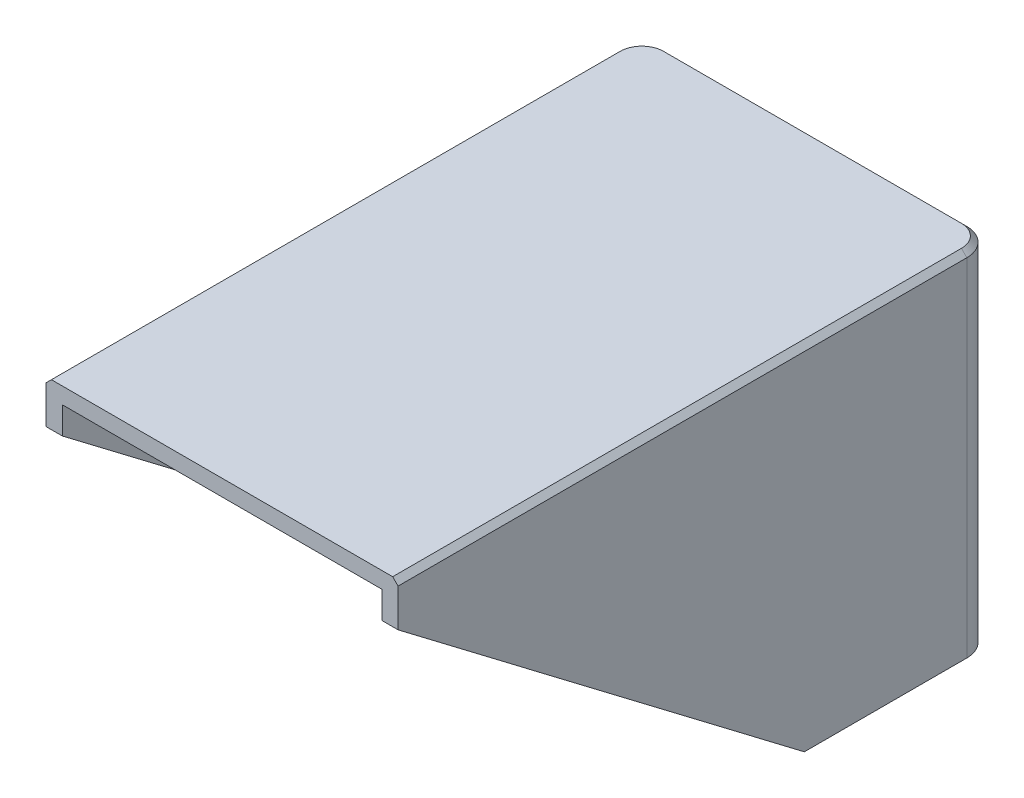
ISO-10303-21;
HEADER;
FILE_DESCRIPTION(('STEP AP214'),'2;1');
FILE_NAME('part.step','',(''),(''),'','','');
FILE_SCHEMA(('AUTOMOTIVE_DESIGN { 1 0 10303 214 1 1 1 1 }'));
ENDSEC;
DATA;
#1=APPLICATION_CONTEXT('core data for automotive mechanical design processes');
#2=APPLICATION_PROTOCOL_DEFINITION('international standard','automotive_design',2000,#1);
#3=PRODUCT_CONTEXT('',#1,'mechanical');
#4=PRODUCT('Part','Part','',(#3));
#5=PRODUCT_RELATED_PRODUCT_CATEGORY('part','',(#4));
#6=PRODUCT_DEFINITION_FORMATION('','',#4);
#7=PRODUCT_DEFINITION_CONTEXT('part definition',#1,'design');
#8=PRODUCT_DEFINITION('design','',#6,#7);
#9=PRODUCT_DEFINITION_SHAPE('','',#8);
#10=(LENGTH_UNIT() NAMED_UNIT(*) SI_UNIT(.MILLI.,.METRE.));
#11=(NAMED_UNIT(*) PLANE_ANGLE_UNIT() SI_UNIT($,.RADIAN.));
#12=(NAMED_UNIT(*) SI_UNIT($,.STERADIAN.) SOLID_ANGLE_UNIT());
#13=UNCERTAINTY_MEASURE_WITH_UNIT(LENGTH_MEASURE(1.E-05),#10,'distance_accuracy_value','');
#14=(GEOMETRIC_REPRESENTATION_CONTEXT(3) GLOBAL_UNCERTAINTY_ASSIGNED_CONTEXT((#13)) GLOBAL_UNIT_ASSIGNED_CONTEXT((#10,
#11,#12)) REPRESENTATION_CONTEXT('',''));
#15=CARTESIAN_POINT('',(0.,0.,0.));
#16=DIRECTION('',(0.,0.,1.));
#17=DIRECTION('',(1.,0.,0.));
#18=AXIS2_PLACEMENT_3D('',#15,#16,#17);
#19=CARTESIAN_POINT('',(0.,77.,0.));
#20=DIRECTION('',(0.,-1.,0.));
#21=DIRECTION('',(0.,0.,-1.));
#22=AXIS2_PLACEMENT_3D('',#19,#20,#21);
#23=PLANE('',#22);
#24=DIRECTION('',(-1.,0.,0.));
#25=VECTOR('',#24,1.);
#26=CARTESIAN_POINT('',(0.,77.,-59.5));
#27=LINE('',#26,#25);
#28=CARTESIAN_POINT('',(27.5,77.,-59.5));
#29=VERTEX_POINT('',#28);
#30=CARTESIAN_POINT('',(-27.5,77.,-59.5));
#31=VERTEX_POINT('',#30);
#32=EDGE_CURVE('E246',#29,#31,#27,.T.);
#33=ORIENTED_EDGE('',*,*,#32,.F.);
#34=CARTESIAN_POINT('',(27.5,77.,-57.5));
#35=DIRECTION('',(0.,-1.,0.));
#36=DIRECTION('',(0.,0.,-1.));
#37=AXIS2_PLACEMENT_3D('',#34,#35,#36);
#38=CIRCLE('',#37,2.);
#39=CARTESIAN_POINT('',(29.5,77.,-57.5));
#40=VERTEX_POINT('',#39);
#41=EDGE_CURVE('E293',#29,#40,#38,.T.);
#42=ORIENTED_EDGE('',*,*,#41,.T.);
#43=DIRECTION('',(0.,0.,-1.));
#44=VECTOR('',#43,1.);
#45=CARTESIAN_POINT('',(29.5,77.,0.));
#46=LINE('',#45,#44);
#47=CARTESIAN_POINT('',(29.5,77.,47.5));
#48=VERTEX_POINT('',#47);
#49=EDGE_CURVE('E242',#48,#40,#46,.T.);
#50=ORIENTED_EDGE('',*,*,#49,.F.);
#51=DIRECTION('',(-1.,0.,0.));
#52=VECTOR('',#51,1.);
#53=CARTESIAN_POINT('',(0.,77.,47.5));
#54=LINE('',#53,#52);
#55=CARTESIAN_POINT('',(-29.5,77.,47.5));
#56=VERTEX_POINT('',#55);
#57=EDGE_CURVE('E253',#48,#56,#54,.T.);
#58=ORIENTED_EDGE('',*,*,#57,.T.);
#59=DIRECTION('',(0.,0.,1.));
#60=VECTOR('',#59,1.);
#61=CARTESIAN_POINT('',(-29.5,77.,0.));
#62=LINE('',#61,#60);
#63=CARTESIAN_POINT('',(-29.5,77.,-57.5));
#64=VERTEX_POINT('',#63);
#65=EDGE_CURVE('E250',#64,#56,#62,.T.);
#66=ORIENTED_EDGE('',*,*,#65,.F.);
#67=CARTESIAN_POINT('',(-27.5,77.,-57.5));
#68=DIRECTION('',(0.,-1.,0.));
#69=DIRECTION('',(0.,0.,-1.));
#70=AXIS2_PLACEMENT_3D('',#67,#68,#69);
#71=CIRCLE('',#70,2.);
#72=EDGE_CURVE('E290',#64,#31,#71,.T.);
#73=ORIENTED_EDGE('',*,*,#72,.T.);
#74=EDGE_LOOP('',(#33,#42,#50,#58,#66,#73));
#75=FACE_BOUND('',#74,.T.);
#76=ADVANCED_FACE('F47',(#75),#23,.T.);
#77=CARTESIAN_POINT('',(-29.5,80.,62.5));
#78=DIRECTION('',(1.,0.,0.));
#79=DIRECTION('',(0.,0.,-1.));
#80=AXIS2_PLACEMENT_3D('',#77,#78,#79);
#81=PLANE('',#80);
#82=DIRECTION('',(0.,0.,-1.));
#83=VECTOR('',#82,1.);
#84=CARTESIAN_POINT('',(-29.5,15.,62.5));
#85=LINE('',#84,#83);
#86=CARTESIAN_POINT('',(-29.5,15.,-27.5));
#87=VERTEX_POINT('',#86);
#88=CARTESIAN_POINT('',(-29.5,15.,-57.5));
#89=VERTEX_POINT('',#88);
#90=EDGE_CURVE('E176',#87,#89,#85,.T.);
#91=ORIENTED_EDGE('',*,*,#90,.T.);
#92=DIRECTION('',(0.,-1.,0.));
#93=VECTOR('',#92,1.);
#94=CARTESIAN_POINT('',(-29.5,77.,-57.5));
#95=LINE('',#94,#93);
#96=EDGE_CURVE('E296',#89,#64,#95,.F.);
#97=ORIENTED_EDGE('',*,*,#96,.T.);
#98=ORIENTED_EDGE('',*,*,#65,.T.);
#99=DIRECTION('',(0.,-1.,0.));
#100=VECTOR('',#99,1.);
#101=CARTESIAN_POINT('',(-29.5,80.,47.5));
#102=LINE('',#101,#100);
#103=CARTESIAN_POINT('',(-29.5,72.,47.5));
#104=VERTEX_POINT('',#103);
#105=EDGE_CURVE('E220',#56,#104,#102,.T.);
#106=ORIENTED_EDGE('',*,*,#105,.T.);
#107=DIRECTION('',(0.,-0.605083267533558,-0.796162194123103));
#108=VECTOR('',#107,1.);
#109=CARTESIAN_POINT('',(-29.5,82.1551724137931,60.8620689655172));
#110=LINE('',#109,#108);
#111=EDGE_CURVE('E257',#104,#87,#110,.T.);
#112=ORIENTED_EDGE('',*,*,#111,.T.);
#113=EDGE_LOOP('',(#91,#97,#98,#106,#112));
#114=FACE_BOUND('',#113,.T.);
#115=ADVANCED_FACE('F425',(#114),#81,.T.);
#116=CARTESIAN_POINT('',(-32.5,80.,-59.5));
#117=DIRECTION('',(0.,0.,1.));
#118=DIRECTION('',(1.,0.,0.));
#119=AXIS2_PLACEMENT_3D('',#116,#117,#118);
#120=PLANE('',#119);
#121=DIRECTION('',(1.,0.,0.));
#122=VECTOR('',#121,1.);
#123=CARTESIAN_POINT('',(-32.5,15.,-59.5));
#124=LINE('',#123,#122);
#125=CARTESIAN_POINT('',(-27.5,15.,-59.5));
#126=VERTEX_POINT('',#125);
#127=CARTESIAN_POINT('',(27.5,15.,-59.5));
#128=VERTEX_POINT('',#127);
#129=EDGE_CURVE('E235',#126,#128,#124,.T.);
#130=ORIENTED_EDGE('',*,*,#129,.T.);
#131=DIRECTION('',(0.,-1.,0.));
#132=VECTOR('',#131,1.);
#133=CARTESIAN_POINT('',(27.5,77.,-59.5));
#134=LINE('',#133,#132);
#135=EDGE_CURVE('E287',#128,#29,#134,.F.);
#136=ORIENTED_EDGE('',*,*,#135,.T.);
#137=ORIENTED_EDGE('',*,*,#32,.T.);
#138=DIRECTION('',(0.,-1.,0.));
#139=VECTOR('',#138,1.);
#140=CARTESIAN_POINT('',(-27.5,15.,-59.5));
#141=LINE('',#140,#139);
#142=EDGE_CURVE('E283',#31,#126,#141,.T.);
#143=ORIENTED_EDGE('',*,*,#142,.T.);
#144=EDGE_LOOP('',(#130,#136,#137,#143));
#145=FACE_BOUND('',#144,.T.);
#146=ADVANCED_FACE('F432',(#145),#120,.T.);
#147=CARTESIAN_POINT('',(29.5,80.,62.5));
#148=DIRECTION('',(-1.,0.,0.));
#149=DIRECTION('',(0.,0.,1.));
#150=AXIS2_PLACEMENT_3D('',#147,#148,#149);
#151=PLANE('',#150);
#152=ORIENTED_EDGE('',*,*,#49,.T.);
#153=DIRECTION('',(0.,-1.,0.));
#154=VECTOR('',#153,1.);
#155=CARTESIAN_POINT('',(29.5,15.,-57.5));
#156=LINE('',#155,#154);
#157=CARTESIAN_POINT('',(29.5,15.,-57.5));
#158=VERTEX_POINT('',#157);
#159=EDGE_CURVE('E279',#40,#158,#156,.T.);
#160=ORIENTED_EDGE('',*,*,#159,.T.);
#161=DIRECTION('',(0.,0.,1.));
#162=VECTOR('',#161,1.);
#163=CARTESIAN_POINT('',(29.5,15.,62.5));
#164=LINE('',#163,#162);
#165=CARTESIAN_POINT('',(29.5,15.,-27.5));
#166=VERTEX_POINT('',#165);
#167=EDGE_CURVE('E239',#158,#166,#164,.T.);
#168=ORIENTED_EDGE('',*,*,#167,.T.);
#169=DIRECTION('',(0.,0.605083267533558,0.796162194123103));
#170=VECTOR('',#169,1.);
#171=CARTESIAN_POINT('',(29.5,82.1551724137931,60.8620689655172));
#172=LINE('',#171,#170);
#173=CARTESIAN_POINT('',(29.5,72.,47.5));
#174=VERTEX_POINT('',#173);
#175=EDGE_CURVE('E231',#166,#174,#172,.T.);
#176=ORIENTED_EDGE('',*,*,#175,.T.);
#177=DIRECTION('',(0.,1.,0.));
#178=VECTOR('',#177,1.);
#179=CARTESIAN_POINT('',(29.5,80.,47.5));
#180=LINE('',#179,#178);
#181=EDGE_CURVE('E227',#174,#48,#180,.T.);
#182=ORIENTED_EDGE('',*,*,#181,.T.);
#183=EDGE_LOOP('',(#152,#160,#168,#176,#182));
#184=FACE_BOUND('',#183,.T.);
#185=ADVANCED_FACE('F551',(#184),#151,.T.);
#186=CARTESIAN_POINT('',(-32.5,72.,47.5));
#187=DIRECTION('',(0.,-0.796162194123103,0.605083267533558));
#188=DIRECTION('',(0.,-0.605083267533558,-0.796162194123103));
#189=AXIS2_PLACEMENT_3D('',#186,#187,#188);
#190=PLANE('',#189);
#191=DIRECTION('',(1.,0.,0.));
#192=VECTOR('',#191,1.);
#193=CARTESIAN_POINT('',(-32.5,15.,-27.5));
#194=LINE('',#193,#192);
#195=CARTESIAN_POINT('',(32.5,15.,-27.5));
#196=VERTEX_POINT('',#195);
#197=EDGE_CURVE('E181',#166,#196,#194,.T.);
#198=ORIENTED_EDGE('',*,*,#197,.T.);
#199=DIRECTION('',(0.,-0.605083267533558,-0.796162194123103));
#200=VECTOR('',#199,1.);
#201=CARTESIAN_POINT('',(32.5,72.,47.5));
#202=LINE('',#201,#200);
#203=CARTESIAN_POINT('',(32.5,72.,47.5));
#204=VERTEX_POINT('',#203);
#205=EDGE_CURVE('E210',#204,#196,#202,.T.);
#206=ORIENTED_EDGE('',*,*,#205,.F.);
#207=DIRECTION('',(1.,0.,0.));
#208=VECTOR('',#207,1.);
#209=CARTESIAN_POINT('',(-32.5,72.,47.5));
#210=LINE('',#209,#208);
#211=EDGE_CURVE('E203',#174,#204,#210,.T.);
#212=ORIENTED_EDGE('',*,*,#211,.F.);
#213=ORIENTED_EDGE('',*,*,#175,.F.);
#214=EDGE_LOOP('',(#198,#206,#212,#213));
#215=FACE_BOUND('',#214,.T.);
#216=ADVANCED_FACE('F374',(#215),#190,.T.);
#217=CARTESIAN_POINT('',(-32.5,15.,-27.5));
#218=DIRECTION('',(0.,-1.,0.));
#219=DIRECTION('',(0.,0.,-1.));
#220=AXIS2_PLACEMENT_3D('',#217,#218,#219);
#221=PLANE('',#220);
#222=DIRECTION('',(0.,0.,-1.));
#223=VECTOR('',#222,1.);
#224=CARTESIAN_POINT('',(-32.5,15.,-27.5));
#225=LINE('',#224,#223);
#226=CARTESIAN_POINT('',(-32.5,15.,-27.5));
#227=VERTEX_POINT('',#226);
#228=CARTESIAN_POINT('',(-32.5,15.,-57.5));
#229=VERTEX_POINT('',#228);
#230=EDGE_CURVE('E174',#227,#229,#225,.T.);
#231=ORIENTED_EDGE('',*,*,#230,.T.);
#232=CARTESIAN_POINT('',(-27.5,15.,-57.5));
#233=DIRECTION('',(0.,-1.,0.));
#234=DIRECTION('',(0.,0.,-1.));
#235=AXIS2_PLACEMENT_3D('',#232,#233,#234);
#236=CIRCLE('',#235,5.);
#237=CARTESIAN_POINT('',(-27.5,15.,-62.5));
#238=VERTEX_POINT('',#237);
#239=EDGE_CURVE('E267',#229,#238,#236,.T.);
#240=ORIENTED_EDGE('',*,*,#239,.T.);
#241=DIRECTION('',(1.,0.,0.));
#242=VECTOR('',#241,1.);
#243=CARTESIAN_POINT('',(-32.5,15.,-62.5));
#244=LINE('',#243,#242);
#245=CARTESIAN_POINT('',(27.5,15.,-62.5));
#246=VERTEX_POINT('',#245);
#247=EDGE_CURVE('E180',#238,#246,#244,.T.);
#248=ORIENTED_EDGE('',*,*,#247,.T.);
#249=CARTESIAN_POINT('',(27.5,15.,-57.5));
#250=DIRECTION('',(0.,-1.,0.));
#251=DIRECTION('',(0.,0.,-1.));
#252=AXIS2_PLACEMENT_3D('',#249,#250,#251);
#253=CIRCLE('',#252,5.);
#254=CARTESIAN_POINT('',(32.5,15.,-57.5));
#255=VERTEX_POINT('',#254);
#256=EDGE_CURVE('E264',#246,#255,#253,.T.);
#257=ORIENTED_EDGE('',*,*,#256,.T.);
#258=DIRECTION('',(0.,0.,-1.));
#259=VECTOR('',#258,1.);
#260=CARTESIAN_POINT('',(32.5,15.,-27.5));
#261=LINE('',#260,#259);
#262=EDGE_CURVE('E214',#196,#255,#261,.T.);
#263=ORIENTED_EDGE('',*,*,#262,.F.);
#264=ORIENTED_EDGE('',*,*,#197,.F.);
#265=ORIENTED_EDGE('',*,*,#167,.F.);
#266=CARTESIAN_POINT('',(27.5,15.,-57.5));
#267=DIRECTION('',(0.,-1.,0.));
#268=DIRECTION('',(0.,0.,-1.));
#269=AXIS2_PLACEMENT_3D('',#266,#267,#268);
#270=CIRCLE('',#269,2.);
#271=EDGE_CURVE('E299',#158,#128,#270,.F.);
#272=ORIENTED_EDGE('',*,*,#271,.T.);
#273=ORIENTED_EDGE('',*,*,#129,.F.);
#274=CARTESIAN_POINT('',(-27.5,15.,-57.5));
#275=DIRECTION('',(0.,-1.,0.));
#276=DIRECTION('',(0.,0.,-1.));
#277=AXIS2_PLACEMENT_3D('',#274,#275,#276);
#278=CIRCLE('',#277,2.);
#279=EDGE_CURVE('E302',#126,#89,#278,.F.);
#280=ORIENTED_EDGE('',*,*,#279,.T.);
#281=ORIENTED_EDGE('',*,*,#90,.F.);
#282=EDGE_CURVE('E170',#227,#87,#194,.T.);
#283=ORIENTED_EDGE('',*,*,#282,.F.);
#284=EDGE_LOOP('',(#231,#240,#248,#257,#263,#264,#265,#272,#273,#280,#281,#283));
#285=FACE_BOUND('',#284,.T.);
#286=ADVANCED_FACE('F172',(#285),#221,.T.);
#287=CARTESIAN_POINT('',(-32.5,72.,47.5));
#288=VERTEX_POINT('',#287);
#289=EDGE_CURVE('E188',#288,#104,#210,.T.);
#290=ORIENTED_EDGE('',*,*,#289,.F.);
#291=DIRECTION('',(0.,-0.605083267533558,-0.796162194123103));
#292=VECTOR('',#291,1.);
#293=CARTESIAN_POINT('',(-32.5,72.,47.5));
#294=LINE('',#293,#292);
#295=EDGE_CURVE('E185',#288,#227,#294,.T.);
#296=ORIENTED_EDGE('',*,*,#295,.T.);
#297=ORIENTED_EDGE('',*,*,#282,.T.);
#298=ORIENTED_EDGE('',*,*,#111,.F.);
#299=EDGE_LOOP('',(#290,#296,#297,#298));
#300=FACE_BOUND('',#299,.T.);
#301=ADVANCED_FACE('F186',(#300),#190,.T.);
#302=CARTESIAN_POINT('',(-32.5,80.,47.5));
#303=DIRECTION('',(0.,0.,1.));
#304=DIRECTION('',(0.,-1.,0.));
#305=AXIS2_PLACEMENT_3D('',#302,#303,#304);
#306=PLANE('',#305);
#307=DIRECTION('',(1.,0.,0.));
#308=VECTOR('',#307,1.);
#309=CARTESIAN_POINT('',(-32.5,80.,47.5));
#310=LINE('',#309,#308);
#311=CARTESIAN_POINT('',(-31.5,80.,47.5));
#312=VERTEX_POINT('',#311);
#313=CARTESIAN_POINT('',(31.5,80.,47.5));
#314=VERTEX_POINT('',#313);
#315=EDGE_CURVE('E199',#312,#314,#310,.T.);
#316=ORIENTED_EDGE('',*,*,#315,.F.);
#317=DIRECTION('',(0.70710678118655,0.707106781186545,0.));
#318=VECTOR('',#317,1.);
#319=CARTESIAN_POINT('',(-32.,79.5,47.5));
#320=LINE('',#319,#318);
#321=CARTESIAN_POINT('',(-32.5,79.,47.5));
#322=VERTEX_POINT('',#321);
#323=EDGE_CURVE('E324',#312,#322,#320,.F.);
#324=ORIENTED_EDGE('',*,*,#323,.T.);
#325=DIRECTION('',(0.,-1.,0.));
#326=VECTOR('',#325,1.);
#327=CARTESIAN_POINT('',(-32.5,80.,47.5));
#328=LINE('',#327,#326);
#329=EDGE_CURVE('E192',#322,#288,#328,.T.);
#330=ORIENTED_EDGE('',*,*,#329,.T.);
#331=ORIENTED_EDGE('',*,*,#289,.T.);
#332=ORIENTED_EDGE('',*,*,#105,.F.);
#333=ORIENTED_EDGE('',*,*,#57,.F.);
#334=ORIENTED_EDGE('',*,*,#181,.F.);
#335=ORIENTED_EDGE('',*,*,#211,.T.);
#336=DIRECTION('',(0.,-1.,0.));
#337=VECTOR('',#336,1.);
#338=CARTESIAN_POINT('',(32.5,80.,47.5));
#339=LINE('',#338,#337);
#340=CARTESIAN_POINT('',(32.5,79.,47.5));
#341=VERTEX_POINT('',#340);
#342=EDGE_CURVE('E207',#341,#204,#339,.T.);
#343=ORIENTED_EDGE('',*,*,#342,.F.);
#344=DIRECTION('',(0.70710678118655,-0.707106781186545,0.));
#345=VECTOR('',#344,1.);
#346=CARTESIAN_POINT('',(-0.500000000000229,112.,47.5));
#347=LINE('',#346,#345);
#348=EDGE_CURVE('E321',#341,#314,#347,.F.);
#349=ORIENTED_EDGE('',*,*,#348,.T.);
#350=EDGE_LOOP('',(#316,#324,#330,#331,#332,#333,#334,#335,#343,#349));
#351=FACE_BOUND('',#350,.T.);
#352=ADVANCED_FACE('F368',(#351),#306,.T.);
#353=CARTESIAN_POINT('',(32.5,80.,62.5));
#354=DIRECTION('',(-1.,0.,0.));
#355=DIRECTION('',(0.,0.,1.));
#356=AXIS2_PLACEMENT_3D('',#353,#354,#355);
#357=PLANE('',#356);
#358=DIRECTION('',(0.,-1.,0.));
#359=VECTOR('',#358,1.);
#360=CARTESIAN_POINT('',(32.5,80.,-57.5));
#361=LINE('',#360,#359);
#362=CARTESIAN_POINT('',(32.5,79.,-57.5));
#363=VERTEX_POINT('',#362);
#364=EDGE_CURVE('E276',#255,#363,#361,.F.);
#365=ORIENTED_EDGE('',*,*,#364,.T.);
#366=DIRECTION('',(0.,0.,1.));
#367=VECTOR('',#366,1.);
#368=CARTESIAN_POINT('',(32.5,79.,62.5));
#369=LINE('',#368,#367);
#370=EDGE_CURVE('E333',#363,#341,#369,.T.);
#371=ORIENTED_EDGE('',*,*,#370,.T.);
#372=ORIENTED_EDGE('',*,*,#342,.T.);
#373=ORIENTED_EDGE('',*,*,#205,.T.);
#374=ORIENTED_EDGE('',*,*,#262,.T.);
#375=EDGE_LOOP('',(#365,#371,#372,#373,#374));
#376=FACE_BOUND('',#375,.T.);
#377=ADVANCED_FACE('F364',(#376),#357,.F.);
#378=CARTESIAN_POINT('',(-32.5,80.,-62.5));
#379=DIRECTION('',(0.,0.,1.));
#380=DIRECTION('',(1.,0.,0.));
#381=AXIS2_PLACEMENT_3D('',#378,#379,#380);
#382=PLANE('',#381);
#383=CARTESIAN_POINT('',(0.,55.,-62.5));
#384=DIRECTION('',(0.,0.,-1.));
#385=DIRECTION('',(-1.,0.,0.));
#386=AXIS2_PLACEMENT_3D('',#383,#384,#385);
#387=CIRCLE('',#386,15.24);
#388=CARTESIAN_POINT('',(-15.24,55.,-62.5));
#389=VERTEX_POINT('',#388);
#390=EDGE_CURVE('E398',#389,#389,#387,.T.);
#391=ORIENTED_EDGE('',*,*,#390,.F.);
#392=EDGE_LOOP('',(#391));
#393=FACE_BOUND('',#392,.T.);
#394=DIRECTION('',(0.,-1.,0.));
#395=VECTOR('',#394,1.);
#396=CARTESIAN_POINT('',(-27.5,80.,-62.5));
#397=LINE('',#396,#395);
#398=CARTESIAN_POINT('',(-27.5,79.,-62.5));
#399=VERTEX_POINT('',#398);
#400=EDGE_CURVE('E273',#238,#399,#397,.F.);
#401=ORIENTED_EDGE('',*,*,#400,.T.);
#402=DIRECTION('',(1.,0.,0.));
#403=VECTOR('',#402,1.);
#404=CARTESIAN_POINT('',(-32.5,79.,-62.5));
#405=LINE('',#404,#403);
#406=CARTESIAN_POINT('',(27.5,79.,-62.5));
#407=VERTEX_POINT('',#406);
#408=EDGE_CURVE('E58',#399,#407,#405,.T.);
#409=ORIENTED_EDGE('',*,*,#408,.T.);
#410=DIRECTION('',(0.,-1.,0.));
#411=VECTOR('',#410,1.);
#412=CARTESIAN_POINT('',(27.5,80.,-62.5));
#413=LINE('',#412,#411);
#414=EDGE_CURVE('E270',#407,#246,#413,.T.);
#415=ORIENTED_EDGE('',*,*,#414,.T.);
#416=ORIENTED_EDGE('',*,*,#247,.F.);
#417=EDGE_LOOP('',(#401,#409,#415,#416));
#418=FACE_BOUND('',#417,.T.);
#419=ADVANCED_FACE('F381',(#393,#418),#382,.F.);
#420=CARTESIAN_POINT('',(-32.5,80.,62.5));
#421=DIRECTION('',(1.,0.,0.));
#422=DIRECTION('',(0.,0.,-1.));
#423=AXIS2_PLACEMENT_3D('',#420,#421,#422);
#424=PLANE('',#423);
#425=ORIENTED_EDGE('',*,*,#329,.F.);
#426=DIRECTION('',(0.,0.,-1.));
#427=VECTOR('',#426,1.);
#428=CARTESIAN_POINT('',(-32.5,79.,62.5));
#429=LINE('',#428,#427);
#430=CARTESIAN_POINT('',(-32.5,79.,-57.5));
#431=VERTEX_POINT('',#430);
#432=EDGE_CURVE('E327',#322,#431,#429,.T.);
#433=ORIENTED_EDGE('',*,*,#432,.T.);
#434=DIRECTION('',(0.,-1.,0.));
#435=VECTOR('',#434,1.);
#436=CARTESIAN_POINT('',(-32.5,80.,-57.5));
#437=LINE('',#436,#435);
#438=EDGE_CURVE('E196',#431,#229,#437,.T.);
#439=ORIENTED_EDGE('',*,*,#438,.T.);
#440=ORIENTED_EDGE('',*,*,#230,.F.);
#441=ORIENTED_EDGE('',*,*,#295,.F.);
#442=EDGE_LOOP('',(#425,#433,#439,#440,#441));
#443=FACE_BOUND('',#442,.T.);
#444=ADVANCED_FACE('F194',(#443),#424,.F.);
#445=CARTESIAN_POINT('',(0.,80.,0.));
#446=DIRECTION('',(0.,-1.,0.));
#447=DIRECTION('',(0.,0.,-1.));
#448=AXIS2_PLACEMENT_3D('',#445,#446,#447);
#449=PLANE('',#448);
#450=CARTESIAN_POINT('',(-27.5,80.,-57.5));
#451=DIRECTION('',(0.,-1.,0.));
#452=DIRECTION('',(0.,0.,-1.));
#453=AXIS2_PLACEMENT_3D('',#450,#451,#452);
#454=CIRCLE('',#453,4.00000000000001);
#455=CARTESIAN_POINT('',(-27.5,80.,-61.5));
#456=VERTEX_POINT('',#455);
#457=CARTESIAN_POINT('',(-31.5,80.,-57.5));
#458=VERTEX_POINT('',#457);
#459=EDGE_CURVE('E314',#456,#458,#454,.F.);
#460=ORIENTED_EDGE('',*,*,#459,.T.);
#461=DIRECTION('',(0.,0.,1.));
#462=VECTOR('',#461,1.);
#463=CARTESIAN_POINT('',(-31.5,80.,0.));
#464=LINE('',#463,#462);
#465=EDGE_CURVE('E317',#458,#312,#464,.T.);
#466=ORIENTED_EDGE('',*,*,#465,.T.);
#467=ORIENTED_EDGE('',*,*,#315,.T.);
#468=DIRECTION('',(0.,0.,-1.));
#469=VECTOR('',#468,1.);
#470=CARTESIAN_POINT('',(31.5,80.,0.));
#471=LINE('',#470,#469);
#472=CARTESIAN_POINT('',(31.5,80.,-57.5));
#473=VERTEX_POINT('',#472);
#474=EDGE_CURVE('E311',#314,#473,#471,.T.);
#475=ORIENTED_EDGE('',*,*,#474,.T.);
#476=CARTESIAN_POINT('',(27.5,80.,-57.5));
#477=DIRECTION('',(0.,-1.,0.));
#478=DIRECTION('',(0.,0.,-1.));
#479=AXIS2_PLACEMENT_3D('',#476,#477,#478);
#480=CIRCLE('',#479,4.);
#481=CARTESIAN_POINT('',(27.5,80.,-61.5));
#482=VERTEX_POINT('',#481);
#483=EDGE_CURVE('E305',#473,#482,#480,.F.);
#484=ORIENTED_EDGE('',*,*,#483,.T.);
#485=DIRECTION('',(-1.,0.,0.));
#486=VECTOR('',#485,1.);
#487=CARTESIAN_POINT('',(0.,80.,-61.5));
#488=LINE('',#487,#486);
#489=EDGE_CURVE('E308',#482,#456,#488,.T.);
#490=ORIENTED_EDGE('',*,*,#489,.T.);
#491=EDGE_LOOP('',(#460,#466,#467,#475,#484,#490));
#492=FACE_BOUND('',#491,.T.);
#493=ADVANCED_FACE('F395',(#492),#449,.F.);
#494=CARTESIAN_POINT('',(-27.5,80.,-57.5));
#495=DIRECTION('',(0.,-1.,0.));
#496=DIRECTION('',(0.,0.,-1.));
#497=AXIS2_PLACEMENT_3D('',#494,#495,#496);
#498=CYLINDRICAL_SURFACE('',#497,5.);
#499=ORIENTED_EDGE('',*,*,#438,.F.);
#500=CARTESIAN_POINT('',(-27.5,79.,-57.5));
#501=DIRECTION('',(0.,-1.,0.));
#502=DIRECTION('',(0.,0.,-1.));
#503=AXIS2_PLACEMENT_3D('',#500,#501,#502);
#504=CIRCLE('',#503,5.);
#505=EDGE_CURVE('E330',#431,#399,#504,.T.);
#506=ORIENTED_EDGE('',*,*,#505,.T.);
#507=ORIENTED_EDGE('',*,*,#400,.F.);
#508=ORIENTED_EDGE('',*,*,#239,.F.);
#509=EDGE_LOOP('',(#499,#506,#507,#508));
#510=FACE_BOUND('',#509,.T.);
#511=ADVANCED_FACE('F383',(#510),#498,.T.);
#512=CARTESIAN_POINT('',(27.5,80.,-57.5));
#513=DIRECTION('',(0.,-1.,0.));
#514=DIRECTION('',(0.,0.,-1.));
#515=AXIS2_PLACEMENT_3D('',#512,#513,#514);
#516=CYLINDRICAL_SURFACE('',#515,5.);
#517=ORIENTED_EDGE('',*,*,#414,.F.);
#518=CARTESIAN_POINT('',(27.5,79.,-57.5));
#519=DIRECTION('',(0.,-1.,0.));
#520=DIRECTION('',(0.,0.,-1.));
#521=AXIS2_PLACEMENT_3D('',#518,#519,#520);
#522=CIRCLE('',#521,5.);
#523=EDGE_CURVE('E12',#407,#363,#522,.T.);
#524=ORIENTED_EDGE('',*,*,#523,.T.);
#525=ORIENTED_EDGE('',*,*,#364,.F.);
#526=ORIENTED_EDGE('',*,*,#256,.F.);
#527=EDGE_LOOP('',(#517,#524,#525,#526));
#528=FACE_BOUND('',#527,.T.);
#529=ADVANCED_FACE('F378',(#528),#516,.T.);
#530=CARTESIAN_POINT('',(27.5,80.,-57.5));
#531=DIRECTION('',(0.,1.,0.));
#532=DIRECTION('',(0.,0.,1.));
#533=AXIS2_PLACEMENT_3D('',#530,#531,#532);
#534=CYLINDRICAL_SURFACE('',#533,2.);
#535=ORIENTED_EDGE('',*,*,#41,.F.);
#536=ORIENTED_EDGE('',*,*,#135,.F.);
#537=ORIENTED_EDGE('',*,*,#271,.F.);
#538=ORIENTED_EDGE('',*,*,#159,.F.);
#539=EDGE_LOOP('',(#535,#536,#537,#538));
#540=FACE_BOUND('',#539,.T.);
#541=ADVANCED_FACE('F447',(#540),#534,.F.);
#542=CARTESIAN_POINT('',(-27.5,80.,-57.5));
#543=DIRECTION('',(0.,1.,0.));
#544=DIRECTION('',(0.,0.,1.));
#545=AXIS2_PLACEMENT_3D('',#542,#543,#544);
#546=CYLINDRICAL_SURFACE('',#545,2.);
#547=ORIENTED_EDGE('',*,*,#72,.F.);
#548=ORIENTED_EDGE('',*,*,#96,.F.);
#549=ORIENTED_EDGE('',*,*,#279,.F.);
#550=ORIENTED_EDGE('',*,*,#142,.F.);
#551=EDGE_LOOP('',(#547,#548,#549,#550));
#552=FACE_BOUND('',#551,.T.);
#553=ADVANCED_FACE('F452',(#552),#546,.F.);
#554=CARTESIAN_POINT('',(31.5,80.,0.));
#555=DIRECTION('',(-0.707106781186545,-0.70710678118655,0.));
#556=DIRECTION('',(0.,0.,-1.));
#557=AXIS2_PLACEMENT_3D('',#554,#555,#556);
#558=PLANE('',#557);
#559=ORIENTED_EDGE('',*,*,#348,.F.);
#560=ORIENTED_EDGE('',*,*,#370,.F.);
#561=DIRECTION('',(0.70710678118655,-0.707106781186545,0.));
#562=VECTOR('',#561,1.);
#563=CARTESIAN_POINT('',(31.5,80.,-57.5));
#564=LINE('',#563,#562);
#565=EDGE_CURVE('E52',#473,#363,#564,.T.);
#566=ORIENTED_EDGE('',*,*,#565,.F.);
#567=ORIENTED_EDGE('',*,*,#474,.F.);
#568=EDGE_LOOP('',(#559,#560,#566,#567));
#569=FACE_BOUND('',#568,.T.);
#570=ADVANCED_FACE('F50',(#569),#558,.F.);
#571=CARTESIAN_POINT('',(27.5,80.,-57.5));
#572=DIRECTION('',(0.,-1.,0.));
#573=DIRECTION('',(0.,0.,-1.));
#574=AXIS2_PLACEMENT_3D('',#571,#572,#573);
#575=CONICAL_SURFACE('',#574,4.,0.785398163397453);
#576=ORIENTED_EDGE('',*,*,#565,.T.);
#577=ORIENTED_EDGE('',*,*,#523,.F.);
#578=DIRECTION('',(0.,-0.707106781186545,-0.70710678118655));
#579=VECTOR('',#578,1.);
#580=CARTESIAN_POINT('',(27.5,80.,-61.5));
#581=LINE('',#580,#579);
#582=EDGE_CURVE('E346',#482,#407,#581,.T.);
#583=ORIENTED_EDGE('',*,*,#582,.F.);
#584=ORIENTED_EDGE('',*,*,#483,.F.);
#585=EDGE_LOOP('',(#576,#577,#583,#584));
#586=FACE_BOUND('',#585,.T.);
#587=ADVANCED_FACE('F357',(#586),#575,.T.);
#588=CARTESIAN_POINT('',(0.,80.,-61.5));
#589=DIRECTION('',(0.,-0.70710678118655,0.707106781186545));
#590=DIRECTION('',(-1.,0.,0.));
#591=AXIS2_PLACEMENT_3D('',#588,#589,#590);
#592=PLANE('',#591);
#593=ORIENTED_EDGE('',*,*,#582,.T.);
#594=ORIENTED_EDGE('',*,*,#408,.F.);
#595=DIRECTION('',(0.,-0.707106781186545,-0.70710678118655));
#596=VECTOR('',#595,1.);
#597=CARTESIAN_POINT('',(-27.5,80.,-61.5));
#598=LINE('',#597,#596);
#599=EDGE_CURVE('E342',#456,#399,#598,.T.);
#600=ORIENTED_EDGE('',*,*,#599,.F.);
#601=ORIENTED_EDGE('',*,*,#489,.F.);
#602=EDGE_LOOP('',(#593,#594,#600,#601));
#603=FACE_BOUND('',#602,.T.);
#604=ADVANCED_FACE('F467',(#603),#592,.F.);
#605=CARTESIAN_POINT('',(-27.5,80.,-57.5));
#606=DIRECTION('',(0.,-1.,0.));
#607=DIRECTION('',(0.,0.,-1.));
#608=AXIS2_PLACEMENT_3D('',#605,#606,#607);
#609=CONICAL_SURFACE('',#608,4.00000000000001,0.785398163397451);
#610=ORIENTED_EDGE('',*,*,#599,.T.);
#611=ORIENTED_EDGE('',*,*,#505,.F.);
#612=DIRECTION('',(-0.70710678118655,-0.707106781186545,0.));
#613=VECTOR('',#612,1.);
#614=CARTESIAN_POINT('',(-31.5,80.,-57.5));
#615=LINE('',#614,#613);
#616=EDGE_CURVE('E338',#458,#431,#615,.T.);
#617=ORIENTED_EDGE('',*,*,#616,.F.);
#618=ORIENTED_EDGE('',*,*,#459,.F.);
#619=EDGE_LOOP('',(#610,#611,#617,#618));
#620=FACE_BOUND('',#619,.T.);
#621=ADVANCED_FACE('F387',(#620),#609,.T.);
#622=CARTESIAN_POINT('',(-31.5,80.,0.));
#623=DIRECTION('',(0.707106781186545,-0.70710678118655,0.));
#624=DIRECTION('',(0.,0.,1.));
#625=AXIS2_PLACEMENT_3D('',#622,#623,#624);
#626=PLANE('',#625);
#627=ORIENTED_EDGE('',*,*,#616,.T.);
#628=ORIENTED_EDGE('',*,*,#432,.F.);
#629=ORIENTED_EDGE('',*,*,#323,.F.);
#630=ORIENTED_EDGE('',*,*,#465,.F.);
#631=EDGE_LOOP('',(#627,#628,#629,#630));
#632=FACE_BOUND('',#631,.T.);
#633=ADVANCED_FACE('F393',(#632),#626,.F.);
#634=CARTESIAN_POINT('',(0.,55.,-62.4));
#635=DIRECTION('',(0.,0.,-1.));
#636=DIRECTION('',(-1.,0.,0.));
#637=AXIS2_PLACEMENT_3D('',#634,#635,#636);
#638=CYLINDRICAL_SURFACE('',#637,15.24);
#639=CARTESIAN_POINT('',(0.,55.,-62.4));
#640=DIRECTION('',(0.,0.,-1.));
#641=DIRECTION('',(-1.,0.,0.));
#642=AXIS2_PLACEMENT_3D('',#639,#640,#641);
#643=CIRCLE('',#642,15.24);
#644=CARTESIAN_POINT('',(-15.24,55.,-62.4));
#645=VERTEX_POINT('',#644);
#646=EDGE_CURVE('E343',#645,#645,#643,.T.);
#647=ORIENTED_EDGE('',*,*,#646,.F.);
#648=EDGE_LOOP('',(#647));
#649=FACE_BOUND('',#648,.T.);
#650=ORIENTED_EDGE('',*,*,#390,.T.);
#651=EDGE_LOOP('',(#650));
#652=FACE_BOUND('',#651,.T.);
#653=ADVANCED_FACE('F408',(#649,#652),#638,.F.);
#654=CARTESIAN_POINT('',(0.,55.,-62.4));
#655=DIRECTION('',(0.,0.,-1.));
#656=DIRECTION('',(-1.,0.,0.));
#657=AXIS2_PLACEMENT_3D('',#654,#655,#656);
#658=PLANE('',#657);
#659=ORIENTED_EDGE('',*,*,#646,.T.);
#660=EDGE_LOOP('',(#659));
#661=FACE_BOUND('',#660,.T.);
#662=ADVANCED_FACE('F406',(#661),#658,.T.);
#663=CLOSED_SHELL('',(#76,#115,#146,#185,#216,#286,#301,#352,#377,#419,#444,#493,#511,#529,#541,
#553,#570,#587,#604,#621,#633,#653,#662));
#664=MANIFOLD_SOLID_BREP('B2',#663);
#665=ADVANCED_BREP_SHAPE_REPRESENTATION('',(#18,#664),#14);
#666=SHAPE_DEFINITION_REPRESENTATION(#9,#665);
ENDSEC;
END-ISO-10303-21;
